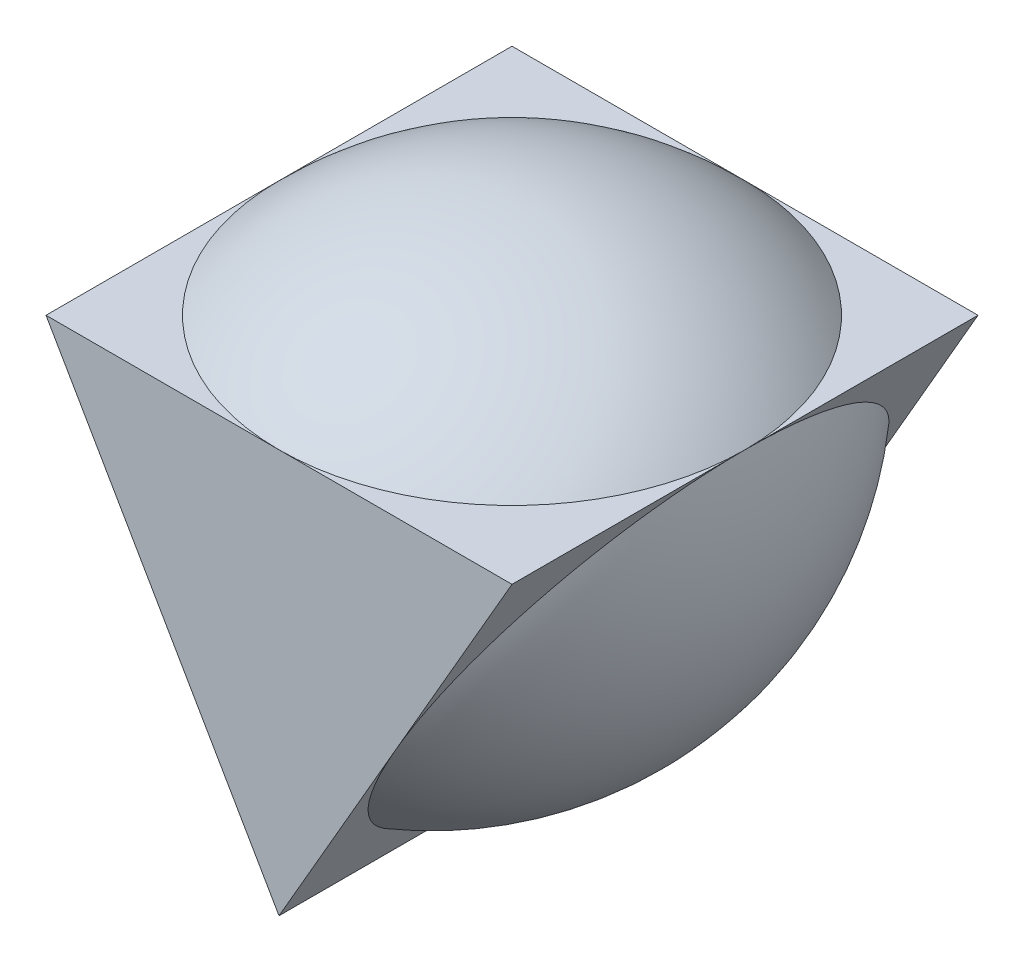
ISO-10303-21;
HEADER;
FILE_DESCRIPTION(('STEP AP214'),'2;1');
FILE_NAME('part.step','',(''),(''),'','','');
FILE_SCHEMA(('AUTOMOTIVE_DESIGN { 1 0 10303 214 1 1 1 1 }'));
ENDSEC;
DATA;
#1=APPLICATION_CONTEXT('core data for automotive mechanical design processes');
#2=APPLICATION_PROTOCOL_DEFINITION('international standard','automotive_design',2000,#1);
#3=PRODUCT_CONTEXT('',#1,'mechanical');
#4=PRODUCT('Part','Part','',(#3));
#5=PRODUCT_RELATED_PRODUCT_CATEGORY('part','',(#4));
#6=PRODUCT_DEFINITION_FORMATION('','',#4);
#7=PRODUCT_DEFINITION_CONTEXT('part definition',#1,'design');
#8=PRODUCT_DEFINITION('design','',#6,#7);
#9=PRODUCT_DEFINITION_SHAPE('','',#8);
#10=(LENGTH_UNIT() NAMED_UNIT(*) SI_UNIT(.MILLI.,.METRE.));
#11=(NAMED_UNIT(*) PLANE_ANGLE_UNIT() SI_UNIT($,.RADIAN.));
#12=(NAMED_UNIT(*) SI_UNIT($,.STERADIAN.) SOLID_ANGLE_UNIT());
#13=UNCERTAINTY_MEASURE_WITH_UNIT(LENGTH_MEASURE(1.E-05),#10,'distance_accuracy_value','');
#14=(GEOMETRIC_REPRESENTATION_CONTEXT(3) GLOBAL_UNCERTAINTY_ASSIGNED_CONTEXT((#13)) GLOBAL_UNIT_ASSIGNED_CONTEXT((#10,
#11,#12)) REPRESENTATION_CONTEXT('',''));
#15=CARTESIAN_POINT('',(0.,0.,0.));
#16=DIRECTION('',(0.,0.,1.));
#17=DIRECTION('',(1.,0.,0.));
#18=AXIS2_PLACEMENT_3D('',#15,#16,#17);
#19=CARTESIAN_POINT('',(-4.99999999999994,-2.88675134594815,-10.));
#20=DIRECTION('',(-0.866025403784435,-0.500000000000007,0.));
#21=DIRECTION('',(0.500000000000007,-0.866025403784435,0.));
#22=AXIS2_PLACEMENT_3D('',#19,#20,#21);
#23=PLANE('',#22);
#24=DIRECTION('',(0.,0.,1.));
#25=VECTOR('',#24,1.);
#26=CARTESIAN_POINT('',(1.21430643318376E-13,-11.5470053837925,-10.));
#27=LINE('',#26,#25);
#28=CARTESIAN_POINT('',(1.21430643318376E-13,-11.5470053837925,-10.));
#29=VERTEX_POINT('',#28);
#30=CARTESIAN_POINT('',(0.,-11.5470053837925,0.));
#31=VERTEX_POINT('',#30);
#32=EDGE_CURVE('E170',#29,#31,#27,.T.);
#33=ORIENTED_EDGE('',*,*,#32,.T.);
#34=CARTESIAN_POINT('',(-5.00000000000004,-2.8867513459481,0.));
#35=DIRECTION('',(-0.866025403784444,-0.499999999999991,0.));
#36=DIRECTION('',(0.499999999999991,-0.866025403784444,0.));
#37=AXIS2_PLACEMENT_3D('',#34,#35,#36);
#38=CIRCLE('',#37,9.99999999999999);
#39=CARTESIAN_POINT('',(-5.00000000000003,-2.88675134594808,-9.99999999999999));
#40=VERTEX_POINT('',#39);
#41=EDGE_CURVE('E117',#40,#31,#38,.T.);
#42=ORIENTED_EDGE('',*,*,#41,.F.);
#43=DIRECTION('',(0.500000000000007,-0.866025403784435,0.));
#44=VECTOR('',#43,1.);
#45=CARTESIAN_POINT('',(-4.99999999999994,-2.88675134594815,-10.));
#46=LINE('',#45,#44);
#47=EDGE_CURVE('E161',#40,#29,#46,.T.);
#48=ORIENTED_EDGE('',*,*,#47,.T.);
#49=EDGE_LOOP('',(#33,#42,#48));
#50=FACE_BOUND('',#49,.T.);
#51=ADVANCED_FACE('F43',(#50),#23,.T.);
#52=CARTESIAN_POINT('',(-9.99999999999999,5.77350269189618,-10.));
#53=VERTEX_POINT('',#52);
#54=EDGE_CURVE('E162',#53,#40,#46,.T.);
#55=ORIENTED_EDGE('',*,*,#54,.T.);
#56=CARTESIAN_POINT('',(-9.99999999999994,5.77350269189631,0.));
#57=VERTEX_POINT('',#56);
#58=EDGE_CURVE('E134',#57,#40,#38,.T.);
#59=ORIENTED_EDGE('',*,*,#58,.F.);
#60=DIRECTION('',(0.,0.,1.));
#61=VECTOR('',#60,1.);
#62=CARTESIAN_POINT('',(-9.99999999999999,5.77350269189618,-10.));
#63=LINE('',#62,#61);
#64=EDGE_CURVE('E47',#53,#57,#63,.T.);
#65=ORIENTED_EDGE('',*,*,#64,.F.);
#66=EDGE_LOOP('',(#55,#59,#65));
#67=FACE_BOUND('',#66,.T.);
#68=ADVANCED_FACE('F232',(#67),#23,.T.);
#69=CARTESIAN_POINT('',(-9.99999999999999,5.77350269189618,10.));
#70=VERTEX_POINT('',#69);
#71=EDGE_CURVE('E132',#57,#70,#63,.T.);
#72=ORIENTED_EDGE('',*,*,#71,.F.);
#73=CARTESIAN_POINT('',(-5.00000000000003,-2.88675134594808,9.99999999999999));
#74=VERTEX_POINT('',#73);
#75=EDGE_CURVE('E114',#74,#57,#38,.T.);
#76=ORIENTED_EDGE('',*,*,#75,.F.);
#77=DIRECTION('',(0.500000000000007,-0.866025403784435,0.));
#78=VECTOR('',#77,1.);
#79=CARTESIAN_POINT('',(-4.99999999999994,-2.88675134594815,10.));
#80=LINE('',#79,#78);
#81=EDGE_CURVE('E130',#70,#74,#80,.T.);
#82=ORIENTED_EDGE('',*,*,#81,.F.);
#83=EDGE_LOOP('',(#72,#76,#82));
#84=FACE_BOUND('',#83,.T.);
#85=ADVANCED_FACE('F128',(#84),#23,.T.);
#86=CARTESIAN_POINT('',(5.00000000000005,-2.88675134594812,-10.));
#87=DIRECTION('',(0.866025403784442,-0.499999999999995,0.));
#88=DIRECTION('',(0.499999999999995,0.866025403784442,0.));
#89=AXIS2_PLACEMENT_3D('',#86,#87,#88);
#90=PLANE('',#89);
#91=DIRECTION('',(0.,0.,1.));
#92=VECTOR('',#91,1.);
#93=CARTESIAN_POINT('',(9.99999999999998,5.77350269189626,-10.));
#94=LINE('',#93,#92);
#95=CARTESIAN_POINT('',(9.99999999999998,5.77350269189626,-10.));
#96=VERTEX_POINT('',#95);
#97=CARTESIAN_POINT('',(9.99999999999998,5.77350269189626,0.));
#98=VERTEX_POINT('',#97);
#99=EDGE_CURVE('E11',#96,#98,#94,.T.);
#100=ORIENTED_EDGE('',*,*,#99,.T.);
#101=CARTESIAN_POINT('',(5.00000000000001,-2.88675134594816,0.));
#102=DIRECTION('',(0.866025403784436,-0.500000000000006,0.));
#103=DIRECTION('',(0.500000000000006,0.866025403784436,0.));
#104=AXIS2_PLACEMENT_3D('',#101,#102,#103);
#105=CIRCLE('',#104,9.99999999999999);
#106=CARTESIAN_POINT('',(4.99999999999999,-2.88675134594816,-9.99999999999999));
#107=VERTEX_POINT('',#106);
#108=EDGE_CURVE('E123',#107,#98,#105,.T.);
#109=ORIENTED_EDGE('',*,*,#108,.F.);
#110=DIRECTION('',(0.499999999999995,0.866025403784442,0.));
#111=VECTOR('',#110,1.);
#112=CARTESIAN_POINT('',(5.00000000000005,-2.88675134594812,-10.));
#113=LINE('',#112,#111);
#114=EDGE_CURVE('E166',#107,#96,#113,.T.);
#115=ORIENTED_EDGE('',*,*,#114,.T.);
#116=EDGE_LOOP('',(#100,#109,#115));
#117=FACE_BOUND('',#116,.T.);
#118=ADVANCED_FACE('F211',(#117),#90,.T.);
#119=EDGE_CURVE('E167',#29,#107,#113,.T.);
#120=ORIENTED_EDGE('',*,*,#119,.T.);
#121=EDGE_CURVE('E202',#31,#107,#105,.T.);
#122=ORIENTED_EDGE('',*,*,#121,.F.);
#123=ORIENTED_EDGE('',*,*,#32,.F.);
#124=EDGE_LOOP('',(#120,#122,#123));
#125=FACE_BOUND('',#124,.T.);
#126=ADVANCED_FACE('F219',(#125),#90,.T.);
#127=CARTESIAN_POINT('',(1.21430643318376E-13,-11.5470053837925,10.));
#128=VERTEX_POINT('',#127);
#129=EDGE_CURVE('E138',#31,#128,#27,.T.);
#130=ORIENTED_EDGE('',*,*,#129,.F.);
#131=CARTESIAN_POINT('',(4.99999999999999,-2.88675134594816,9.99999999999999));
#132=VERTEX_POINT('',#131);
#133=EDGE_CURVE('E197',#132,#31,#105,.T.);
#134=ORIENTED_EDGE('',*,*,#133,.F.);
#135=DIRECTION('',(0.499999999999995,0.866025403784442,0.));
#136=VECTOR('',#135,1.);
#137=CARTESIAN_POINT('',(5.00000000000005,-2.88675134594812,10.));
#138=LINE('',#137,#136);
#139=EDGE_CURVE('E150',#128,#132,#138,.T.);
#140=ORIENTED_EDGE('',*,*,#139,.F.);
#141=EDGE_LOOP('',(#130,#134,#140));
#142=FACE_BOUND('',#141,.T.);
#143=ADVANCED_FACE('F221',(#142),#90,.T.);
#144=CARTESIAN_POINT('',(0.,5.77350269189622,-10.));
#145=DIRECTION('',(0.,-1.,0.));
#146=DIRECTION('',(1.,0.,0.));
#147=AXIS2_PLACEMENT_3D('',#144,#145,#146);
#148=PLANE('',#147);
#149=CARTESIAN_POINT('',(0.,5.77350269189628,0.));
#150=DIRECTION('',(0.,1.,0.));
#151=DIRECTION('',(-1.,0.,0.));
#152=AXIS2_PLACEMENT_3D('',#149,#150,#151);
#153=CIRCLE('',#152,9.99999999999999);
#154=CARTESIAN_POINT('',(0.,5.77350269189622,-10.));
#155=VERTEX_POINT('',#154);
#156=EDGE_CURVE('E190',#98,#155,#153,.T.);
#157=ORIENTED_EDGE('',*,*,#156,.F.);
#158=ORIENTED_EDGE('',*,*,#99,.F.);
#159=DIRECTION('',(1.,0.,0.));
#160=VECTOR('',#159,1.);
#161=CARTESIAN_POINT('',(0.,5.77350269189622,-10.));
#162=LINE('',#161,#160);
#163=EDGE_CURVE('E156',#155,#96,#162,.T.);
#164=ORIENTED_EDGE('',*,*,#163,.F.);
#165=EDGE_LOOP('',(#157,#158,#164));
#166=FACE_BOUND('',#165,.T.);
#167=ADVANCED_FACE('F227',(#166),#148,.F.);
#168=EDGE_CURVE('E61',#155,#57,#153,.T.);
#169=ORIENTED_EDGE('',*,*,#168,.F.);
#170=EDGE_CURVE('E157',#53,#155,#162,.T.);
#171=ORIENTED_EDGE('',*,*,#170,.F.);
#172=ORIENTED_EDGE('',*,*,#64,.T.);
#173=EDGE_LOOP('',(#169,#171,#172));
#174=FACE_BOUND('',#173,.T.);
#175=ADVANCED_FACE('F272',(#174),#148,.F.);
#176=CARTESIAN_POINT('',(0.,5.77350269189622,10.));
#177=VERTEX_POINT('',#176);
#178=EDGE_CURVE('E184',#57,#177,#153,.T.);
#179=ORIENTED_EDGE('',*,*,#178,.F.);
#180=ORIENTED_EDGE('',*,*,#71,.T.);
#181=DIRECTION('',(1.,0.,0.));
#182=VECTOR('',#181,1.);
#183=CARTESIAN_POINT('',(0.,5.77350269189622,10.));
#184=LINE('',#183,#182);
#185=EDGE_CURVE('E143',#70,#177,#184,.T.);
#186=ORIENTED_EDGE('',*,*,#185,.T.);
#187=EDGE_LOOP('',(#179,#180,#186));
#188=FACE_BOUND('',#187,.T.);
#189=ADVANCED_FACE('F182',(#188),#148,.F.);
#190=EDGE_CURVE('E69',#177,#98,#153,.T.);
#191=ORIENTED_EDGE('',*,*,#190,.F.);
#192=CARTESIAN_POINT('',(9.99999999999998,5.77350269189626,10.));
#193=VERTEX_POINT('',#192);
#194=EDGE_CURVE('E187',#177,#193,#184,.T.);
#195=ORIENTED_EDGE('',*,*,#194,.T.);
#196=EDGE_CURVE('E53',#98,#193,#94,.T.);
#197=ORIENTED_EDGE('',*,*,#196,.F.);
#198=EDGE_LOOP('',(#191,#195,#197));
#199=FACE_BOUND('',#198,.T.);
#200=ADVANCED_FACE('F45',(#199),#148,.F.);
#201=EDGE_CURVE('E148',#132,#193,#138,.T.);
#202=ORIENTED_EDGE('',*,*,#201,.F.);
#203=EDGE_CURVE('E193',#98,#132,#105,.T.);
#204=ORIENTED_EDGE('',*,*,#203,.F.);
#205=ORIENTED_EDGE('',*,*,#196,.T.);
#206=EDGE_LOOP('',(#202,#204,#205));
#207=FACE_BOUND('',#206,.T.);
#208=ADVANCED_FACE('F229',(#207),#90,.T.);
#209=EDGE_CURVE('E135',#74,#128,#80,.T.);
#210=ORIENTED_EDGE('',*,*,#209,.F.);
#211=EDGE_CURVE('E111',#31,#74,#38,.T.);
#212=ORIENTED_EDGE('',*,*,#211,.F.);
#213=ORIENTED_EDGE('',*,*,#129,.T.);
#214=EDGE_LOOP('',(#210,#212,#213));
#215=FACE_BOUND('',#214,.T.);
#216=ADVANCED_FACE('F136',(#215),#23,.T.);
#217=CARTESIAN_POINT('',(0.,0.,-10.));
#218=DIRECTION('',(0.,0.,1.));
#219=DIRECTION('',(1.,0.,0.));
#220=AXIS2_PLACEMENT_3D('',#217,#218,#219);
#221=PLANE('',#220);
#222=ORIENTED_EDGE('',*,*,#170,.T.);
#223=ORIENTED_EDGE('',*,*,#163,.T.);
#224=ORIENTED_EDGE('',*,*,#114,.F.);
#225=ORIENTED_EDGE('',*,*,#119,.F.);
#226=ORIENTED_EDGE('',*,*,#47,.F.);
#227=ORIENTED_EDGE('',*,*,#54,.F.);
#228=EDGE_LOOP('',(#222,#223,#224,#225,#226,#227));
#229=FACE_BOUND('',#228,.T.);
#230=ADVANCED_FACE('F216',(#229),#221,.F.);
#231=CARTESIAN_POINT('',(0.,0.,10.));
#232=DIRECTION('',(0.,0.,1.));
#233=DIRECTION('',(1.,0.,0.));
#234=AXIS2_PLACEMENT_3D('',#231,#232,#233);
#235=PLANE('',#234);
#236=ORIENTED_EDGE('',*,*,#185,.F.);
#237=ORIENTED_EDGE('',*,*,#81,.T.);
#238=ORIENTED_EDGE('',*,*,#209,.T.);
#239=ORIENTED_EDGE('',*,*,#139,.T.);
#240=ORIENTED_EDGE('',*,*,#201,.T.);
#241=ORIENTED_EDGE('',*,*,#194,.F.);
#242=EDGE_LOOP('',(#236,#237,#238,#239,#240,#241));
#243=FACE_BOUND('',#242,.T.);
#244=ADVANCED_FACE('F145',(#243),#235,.T.);
#245=CARTESIAN_POINT('',(0.,-4.,0.));
#246=DIRECTION('',(0.,1.,0.));
#247=DIRECTION('',(1.,0.,0.));
#248=AXIS2_PLACEMENT_3D('',#245,#246,#247);
#249=SPHERICAL_SURFACE('',#248,13.9828950817956);
#250=ORIENTED_EDGE('',*,*,#178,.T.);
#251=ORIENTED_EDGE('',*,*,#190,.T.);
#252=ORIENTED_EDGE('',*,*,#156,.T.);
#253=ORIENTED_EDGE('',*,*,#168,.T.);
#254=EDGE_LOOP('',(#250,#251,#252,#253));
#255=FACE_BOUND('',#254,.T.);
#256=ADVANCED_FACE('F322',(#255),#249,.T.);
#257=CARTESIAN_POINT('',(-3.46410161513775,2.00000000000002,0.));
#258=DIRECTION('',(0.866025403784436,-0.500000000000006,0.));
#259=DIRECTION('',(-0.500000000000006,-0.866025403784436,0.));
#260=AXIS2_PLACEMENT_3D('',#257,#258,#259);
#261=SPHERICAL_SURFACE('',#260,13.9828950817956);
#262=ORIENTED_EDGE('',*,*,#203,.T.);
#263=ORIENTED_EDGE('',*,*,#133,.T.);
#264=ORIENTED_EDGE('',*,*,#121,.T.);
#265=ORIENTED_EDGE('',*,*,#108,.T.);
#266=EDGE_LOOP('',(#262,#263,#264,#265));
#267=FACE_BOUND('',#266,.T.);
#268=ADVANCED_FACE('F207',(#267),#261,.T.);
#269=CARTESIAN_POINT('',(3.46410161513777,1.99999999999997,0.));
#270=DIRECTION('',(-0.866025403784444,-0.499999999999991,0.));
#271=DIRECTION('',(-0.499999999999991,0.866025403784444,0.));
#272=AXIS2_PLACEMENT_3D('',#269,#270,#271);
#273=SPHERICAL_SURFACE('',#272,13.9828950817956);
#274=ORIENTED_EDGE('',*,*,#211,.T.);
#275=ORIENTED_EDGE('',*,*,#75,.T.);
#276=ORIENTED_EDGE('',*,*,#58,.T.);
#277=ORIENTED_EDGE('',*,*,#41,.T.);
#278=EDGE_LOOP('',(#274,#275,#276,#277));
#279=FACE_BOUND('',#278,.T.);
#280=ADVANCED_FACE('F113',(#279),#273,.T.);
#281=CLOSED_SHELL('',(#51,#68,#85,#118,#126,#143,#167,#175,#189,#200,#208,#216,#230,#244,#256,
#268,#280));
#282=MANIFOLD_SOLID_BREP('B2',#281);
#283=ADVANCED_BREP_SHAPE_REPRESENTATION('',(#18,#282),#14);
#284=SHAPE_DEFINITION_REPRESENTATION(#9,#283);
ENDSEC;
END-ISO-10303-21;
